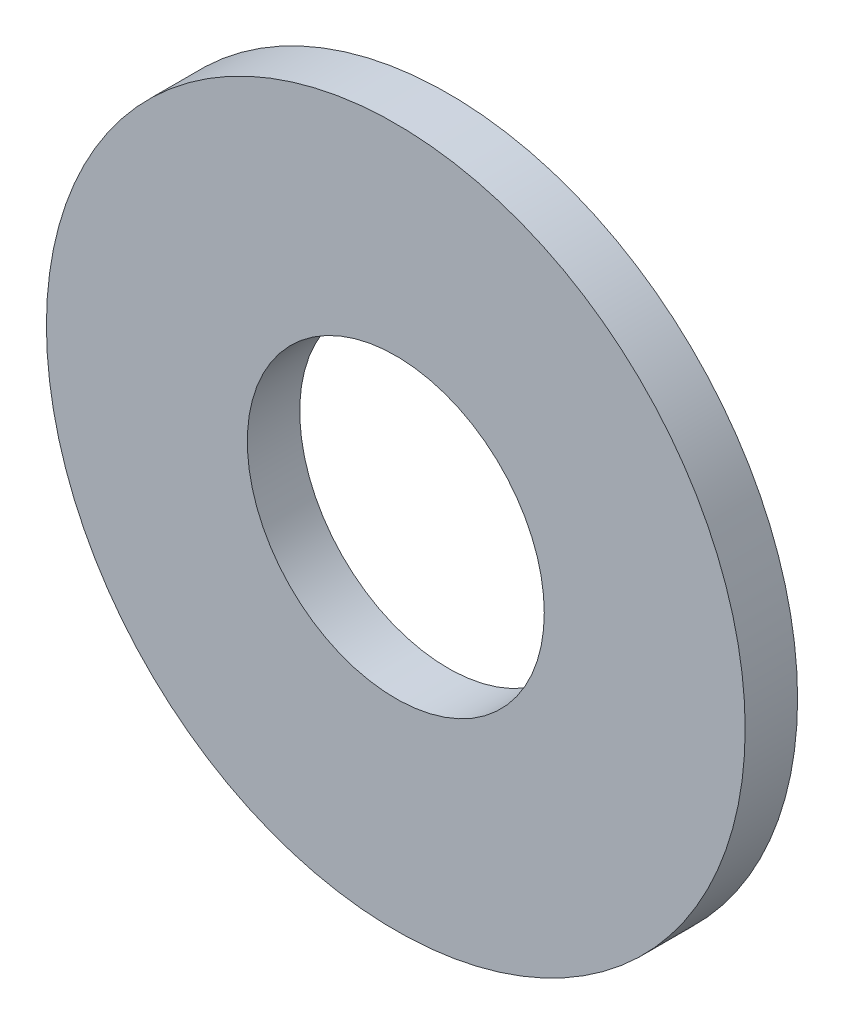
ISO-10303-21;
HEADER;
FILE_DESCRIPTION(('STEP AP214'),'2;1');
FILE_NAME('part.step','',(''),(''),'','','');
FILE_SCHEMA(('AUTOMOTIVE_DESIGN { 1 0 10303 214 1 1 1 1 }'));
ENDSEC;
DATA;
#1=APPLICATION_CONTEXT('core data for automotive mechanical design processes');
#2=APPLICATION_PROTOCOL_DEFINITION('international standard','automotive_design',2000,#1);
#3=PRODUCT_CONTEXT('',#1,'mechanical');
#4=PRODUCT('Part','Part','',(#3));
#5=PRODUCT_RELATED_PRODUCT_CATEGORY('part','',(#4));
#6=PRODUCT_DEFINITION_FORMATION('','',#4);
#7=PRODUCT_DEFINITION_CONTEXT('part definition',#1,'design');
#8=PRODUCT_DEFINITION('design','',#6,#7);
#9=PRODUCT_DEFINITION_SHAPE('','',#8);
#10=(LENGTH_UNIT() NAMED_UNIT(*) SI_UNIT(.MILLI.,.METRE.));
#11=(NAMED_UNIT(*) PLANE_ANGLE_UNIT() SI_UNIT($,.RADIAN.));
#12=(NAMED_UNIT(*) SI_UNIT($,.STERADIAN.) SOLID_ANGLE_UNIT());
#13=UNCERTAINTY_MEASURE_WITH_UNIT(LENGTH_MEASURE(1.E-05),#10,'distance_accuracy_value','');
#14=(GEOMETRIC_REPRESENTATION_CONTEXT(3) GLOBAL_UNCERTAINTY_ASSIGNED_CONTEXT((#13)) GLOBAL_UNIT_ASSIGNED_CONTEXT((#10,
#11,#12)) REPRESENTATION_CONTEXT('',''));
#15=CARTESIAN_POINT('',(0.,0.,0.));
#16=DIRECTION('',(0.,0.,1.));
#17=DIRECTION('',(1.,0.,0.));
#18=AXIS2_PLACEMENT_3D('',#15,#16,#17);
#19=CARTESIAN_POINT('',(0.,0.,0.3));
#20=DIRECTION('',(0.,0.,1.));
#21=DIRECTION('',(1.,0.,0.));
#22=AXIS2_PLACEMENT_3D('',#19,#20,#21);
#23=PLANE('',#22);
#24=CARTESIAN_POINT('',(0.,0.,0.3));
#25=DIRECTION('',(0.,0.,1.));
#26=DIRECTION('',(1.,0.,0.));
#27=AXIS2_PLACEMENT_3D('',#24,#25,#26);
#28=CIRCLE('',#27,2.);
#29=CARTESIAN_POINT('',(2.,0.,0.3));
#30=VERTEX_POINT('',#29);
#31=EDGE_CURVE('E10',#30,#30,#28,.T.);
#32=ORIENTED_EDGE('',*,*,#31,.T.);
#33=EDGE_LOOP('',(#32));
#34=FACE_BOUND('',#33,.T.);
#35=CARTESIAN_POINT('',(0.,0.,0.3));
#36=DIRECTION('',(0.,0.,1.));
#37=DIRECTION('',(1.,0.,0.));
#38=AXIS2_PLACEMENT_3D('',#35,#36,#37);
#39=CIRCLE('',#38,0.85);
#40=CARTESIAN_POINT('',(0.85,0.,0.3));
#41=VERTEX_POINT('',#40);
#42=EDGE_CURVE('E42',#41,#41,#39,.T.);
#43=ORIENTED_EDGE('',*,*,#42,.F.);
#44=EDGE_LOOP('',(#43));
#45=FACE_BOUND('',#44,.T.);
#46=ADVANCED_FACE('F31',(#34,#45),#23,.T.);
#47=CARTESIAN_POINT('',(0.,0.,0.));
#48=DIRECTION('',(0.,0.,1.));
#49=DIRECTION('',(1.,0.,0.));
#50=AXIS2_PLACEMENT_3D('',#47,#48,#49);
#51=PLANE('',#50);
#52=CARTESIAN_POINT('',(0.,0.,0.));
#53=DIRECTION('',(0.,0.,1.));
#54=DIRECTION('',(1.,0.,0.));
#55=AXIS2_PLACEMENT_3D('',#52,#53,#54);
#56=CIRCLE('',#55,2.);
#57=CARTESIAN_POINT('',(2.,0.,0.));
#58=VERTEX_POINT('',#57);
#59=EDGE_CURVE('E35',#58,#58,#56,.T.);
#60=ORIENTED_EDGE('',*,*,#59,.F.);
#61=EDGE_LOOP('',(#60));
#62=FACE_BOUND('',#61,.T.);
#63=CARTESIAN_POINT('',(0.,0.,0.));
#64=DIRECTION('',(0.,0.,1.));
#65=DIRECTION('',(1.,0.,0.));
#66=AXIS2_PLACEMENT_3D('',#63,#64,#65);
#67=CIRCLE('',#66,0.85);
#68=CARTESIAN_POINT('',(0.85,0.,0.));
#69=VERTEX_POINT('',#68);
#70=EDGE_CURVE('E44',#69,#69,#67,.T.);
#71=ORIENTED_EDGE('',*,*,#70,.T.);
#72=EDGE_LOOP('',(#71));
#73=FACE_BOUND('',#72,.T.);
#74=ADVANCED_FACE('F54',(#62,#73),#51,.F.);
#75=CARTESIAN_POINT('',(0.,0.,0.3));
#76=DIRECTION('',(0.,0.,-1.));
#77=DIRECTION('',(-1.,0.,0.));
#78=AXIS2_PLACEMENT_3D('',#75,#76,#77);
#79=CYLINDRICAL_SURFACE('',#78,2.);
#80=ORIENTED_EDGE('',*,*,#31,.F.);
#81=EDGE_LOOP('',(#80));
#82=FACE_BOUND('',#81,.T.);
#83=ORIENTED_EDGE('',*,*,#59,.T.);
#84=EDGE_LOOP('',(#83));
#85=FACE_BOUND('',#84,.T.);
#86=ADVANCED_FACE('F33',(#82,#85),#79,.T.);
#87=CARTESIAN_POINT('',(0.,0.,0.3));
#88=DIRECTION('',(0.,0.,-1.));
#89=DIRECTION('',(-1.,0.,0.));
#90=AXIS2_PLACEMENT_3D('',#87,#88,#89);
#91=CYLINDRICAL_SURFACE('',#90,0.85);
#92=ORIENTED_EDGE('',*,*,#42,.T.);
#93=EDGE_LOOP('',(#92));
#94=FACE_BOUND('',#93,.T.);
#95=ORIENTED_EDGE('',*,*,#70,.F.);
#96=EDGE_LOOP('',(#95));
#97=FACE_BOUND('',#96,.T.);
#98=ADVANCED_FACE('F50',(#94,#97),#91,.F.);
#99=CLOSED_SHELL('',(#46,#74,#86,#98));
#100=MANIFOLD_SOLID_BREP('B2',#99);
#101=ADVANCED_BREP_SHAPE_REPRESENTATION('',(#18,#100),#14);
#102=SHAPE_DEFINITION_REPRESENTATION(#9,#101);
ENDSEC;
END-ISO-10303-21;
